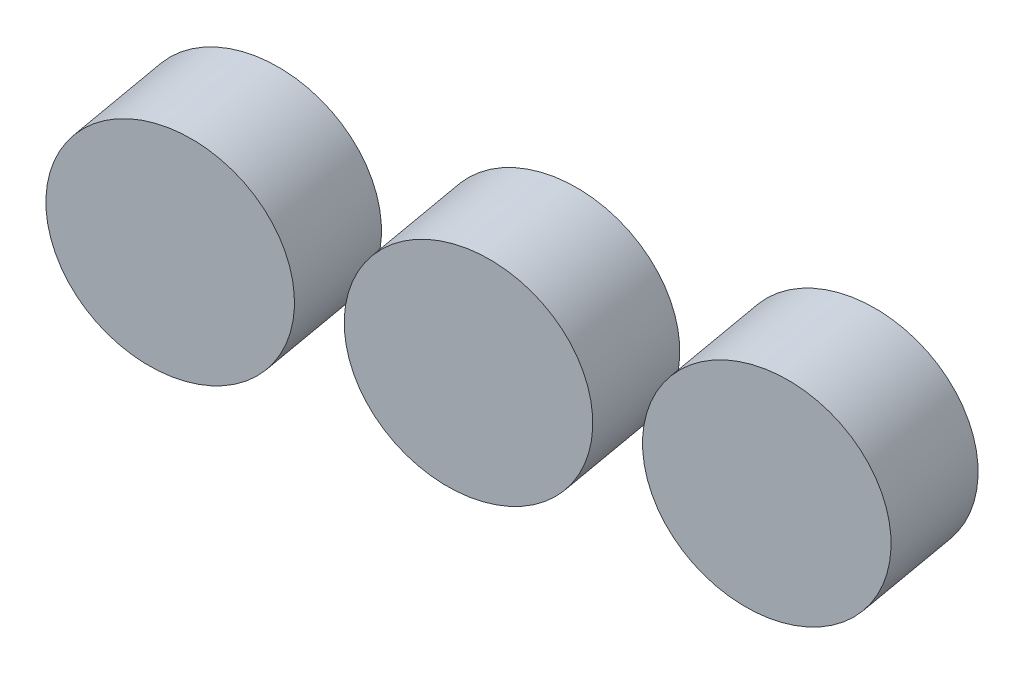
ISO-10303-21;
HEADER;
FILE_DESCRIPTION(('STEP AP214'),'2;1');
FILE_NAME('part.step','',(''),(''),'','','');
FILE_SCHEMA(('AUTOMOTIVE_DESIGN { 1 0 10303 214 1 1 1 1 }'));
ENDSEC;
DATA;
#1=APPLICATION_CONTEXT('core data for automotive mechanical design processes');
#2=APPLICATION_PROTOCOL_DEFINITION('international standard','automotive_design',2000,#1);
#3=PRODUCT_CONTEXT('',#1,'mechanical');
#4=PRODUCT('Part','Part','',(#3));
#5=PRODUCT_RELATED_PRODUCT_CATEGORY('part','',(#4));
#6=PRODUCT_DEFINITION_FORMATION('','',#4);
#7=PRODUCT_DEFINITION_CONTEXT('part definition',#1,'design');
#8=PRODUCT_DEFINITION('design','',#6,#7);
#9=PRODUCT_DEFINITION_SHAPE('','',#8);
#10=(LENGTH_UNIT() NAMED_UNIT(*) SI_UNIT(.MILLI.,.METRE.));
#11=(NAMED_UNIT(*) PLANE_ANGLE_UNIT() SI_UNIT($,.RADIAN.));
#12=(NAMED_UNIT(*) SI_UNIT($,.STERADIAN.) SOLID_ANGLE_UNIT());
#13=UNCERTAINTY_MEASURE_WITH_UNIT(LENGTH_MEASURE(1.E-05),#10,'distance_accuracy_value','');
#14=(GEOMETRIC_REPRESENTATION_CONTEXT(3) GLOBAL_UNCERTAINTY_ASSIGNED_CONTEXT((#13)) GLOBAL_UNIT_ASSIGNED_CONTEXT((#10,
#11,#12)) REPRESENTATION_CONTEXT('',''));
#15=CARTESIAN_POINT('',(0.,0.,0.));
#16=DIRECTION('',(0.,0.,1.));
#17=DIRECTION('',(1.,0.,0.));
#18=AXIS2_PLACEMENT_3D('',#15,#16,#17);
#19=CARTESIAN_POINT('',(-1156.35386072293,336.999999999994,1700.32688113994));
#20=DIRECTION('',(0.17364817766693,0.,0.984807753012208));
#21=DIRECTION('',(0.171010071662834,-0.984807753012208,-0.030153689607045));
#22=AXIS2_PLACEMENT_3D('',#19,#20,#21);
#23=CYLINDRICAL_SURFACE('',#22,25.);
#24=CARTESIAN_POINT('',(-1156.35386072293,336.999999999994,1700.32688113994));
#25=DIRECTION('',(-0.17364817766693,0.,-0.984807753012208));
#26=DIRECTION('',(0.969846310392954,0.17364817766693,-0.171010071662834));
#27=AXIS2_PLACEMENT_3D('',#24,#25,#26);
#28=CIRCLE('',#27,25.);
#29=CARTESIAN_POINT('',(-1132.10770296311,341.341204441668,1696.05162934837));
#30=VERTEX_POINT('',#29);
#31=EDGE_CURVE('E10',#30,#30,#28,.T.);
#32=ORIENTED_EDGE('',*,*,#31,.F.);
#33=EDGE_LOOP('',(#32));
#34=FACE_BOUND('',#33,.T.);
#35=CARTESIAN_POINT('',(-1152.01265628126,336.999999999994,1724.94707496524));
#36=DIRECTION('',(-0.17364817766693,0.,-0.984807753012208));
#37=DIRECTION('',(0.969846310392954,0.17364817766693,-0.171010071662834));
#38=AXIS2_PLACEMENT_3D('',#35,#36,#37);
#39=CIRCLE('',#38,25.);
#40=CARTESIAN_POINT('',(-1127.76649852143,341.341204441668,1720.67182317367));
#41=VERTEX_POINT('',#40);
#42=EDGE_CURVE('E23',#41,#41,#39,.T.);
#43=ORIENTED_EDGE('',*,*,#42,.T.);
#44=EDGE_LOOP('',(#43));
#45=FACE_BOUND('',#44,.T.);
#46=ADVANCED_FACE('F15',(#34,#45),#23,.T.);
#47=CARTESIAN_POINT('',(-1156.35386072293,336.999999999994,1700.32688113994));
#48=DIRECTION('',(-0.17364817766693,0.,-0.984807753012208));
#49=DIRECTION('',(-0.171010071662834,0.984807753012208,0.030153689607045));
#50=AXIS2_PLACEMENT_3D('',#47,#48,#49);
#51=PLANE('',#50);
#52=ORIENTED_EDGE('',*,*,#31,.T.);
#53=EDGE_LOOP('',(#52));
#54=FACE_BOUND('',#53,.T.);
#55=ADVANCED_FACE('F129',(#54),#51,.T.);
#56=CARTESIAN_POINT('',(-1152.01265628126,336.999999999994,1724.94707496524));
#57=DIRECTION('',(-0.17364817766693,0.,-0.984807753012208));
#58=DIRECTION('',(-0.171010071662834,0.984807753012208,0.030153689607045));
#59=AXIS2_PLACEMENT_3D('',#56,#57,#58);
#60=PLANE('',#59);
#61=ORIENTED_EDGE('',*,*,#42,.F.);
#62=EDGE_LOOP('',(#61));
#63=FACE_BOUND('',#62,.T.);
#64=ADVANCED_FACE('F125',(#63),#60,.F.);
#65=CLOSED_SHELL('',(#46,#55,#64));
#66=MANIFOLD_SOLID_BREP('B1',#65);
#67=CARTESIAN_POINT('',(-1097.2653955422,336.999999999995,1689.90799047993));
#68=DIRECTION('',(0.17364817766693,0.,0.984807753012208));
#69=DIRECTION('',(0.171010071662834,-0.984807753012208,-0.030153689607045));
#70=AXIS2_PLACEMENT_3D('',#67,#68,#69);
#71=CYLINDRICAL_SURFACE('',#70,25.);
#72=CARTESIAN_POINT('',(-1097.2653955422,336.999999999995,1689.90799047993));
#73=DIRECTION('',(-0.17364817766693,0.,-0.984807753012208));
#74=DIRECTION('',(0.969846310392954,0.17364817766693,-0.171010071662834));
#75=AXIS2_PLACEMENT_3D('',#72,#73,#74);
#76=CIRCLE('',#75,25.);
#77=CARTESIAN_POINT('',(-1073.01923778238,341.341204441668,1685.63273868835));
#78=VERTEX_POINT('',#77);
#79=EDGE_CURVE('E29',#78,#78,#76,.T.);
#80=ORIENTED_EDGE('',*,*,#79,.F.);
#81=EDGE_LOOP('',(#80));
#82=FACE_BOUND('',#81,.T.);
#83=CARTESIAN_POINT('',(-1092.92419110053,336.999999999995,1714.52818430523));
#84=DIRECTION('',(-0.17364817766693,0.,-0.984807753012208));
#85=DIRECTION('',(0.969846310392954,0.17364817766693,-0.171010071662834));
#86=AXIS2_PLACEMENT_3D('',#83,#84,#85);
#87=CIRCLE('',#86,25.);
#88=CARTESIAN_POINT('',(-1068.6780333407,341.341204441668,1710.25293251366));
#89=VERTEX_POINT('',#88);
#90=EDGE_CURVE('E32',#89,#89,#87,.T.);
#91=ORIENTED_EDGE('',*,*,#90,.T.);
#92=EDGE_LOOP('',(#91));
#93=FACE_BOUND('',#92,.T.);
#94=ADVANCED_FACE('F61',(#82,#93),#71,.T.);
#95=CARTESIAN_POINT('',(-1097.2653955422,336.999999999995,1689.90799047993));
#96=DIRECTION('',(-0.17364817766693,0.,-0.984807753012208));
#97=DIRECTION('',(-0.171010071662834,0.984807753012208,0.030153689607045));
#98=AXIS2_PLACEMENT_3D('',#95,#96,#97);
#99=PLANE('',#98);
#100=ORIENTED_EDGE('',*,*,#79,.T.);
#101=EDGE_LOOP('',(#100));
#102=FACE_BOUND('',#101,.T.);
#103=ADVANCED_FACE('F63',(#102),#99,.T.);
#104=CARTESIAN_POINT('',(-1092.92419110053,336.999999999995,1714.52818430523));
#105=DIRECTION('',(-0.17364817766693,0.,-0.984807753012208));
#106=DIRECTION('',(-0.171010071662834,0.984807753012208,0.030153689607045));
#107=AXIS2_PLACEMENT_3D('',#104,#105,#106);
#108=PLANE('',#107);
#109=ORIENTED_EDGE('',*,*,#90,.F.);
#110=EDGE_LOOP('',(#109));
#111=FACE_BOUND('',#110,.T.);
#112=ADVANCED_FACE('F71',(#111),#108,.F.);
#113=CLOSED_SHELL('',(#94,#103,#112));
#114=MANIFOLD_SOLID_BREP('B1',#113);
#115=CARTESIAN_POINT('',(-1038.17693036147,336.999999999995,1679.48909981991));
#116=DIRECTION('',(0.17364817766693,0.,0.984807753012208));
#117=DIRECTION('',(0.171010071662834,-0.984807753012208,-0.030153689607045));
#118=AXIS2_PLACEMENT_3D('',#115,#116,#117);
#119=CYLINDRICAL_SURFACE('',#118,25.);
#120=CARTESIAN_POINT('',(-1038.17693036147,336.999999999995,1679.48909981991));
#121=DIRECTION('',(-0.17364817766693,0.,-0.984807753012208));
#122=DIRECTION('',(0.969846310392954,0.17364817766693,-0.171010071662834));
#123=AXIS2_PLACEMENT_3D('',#120,#121,#122);
#124=CIRCLE('',#123,25.);
#125=CARTESIAN_POINT('',(-1013.93077260164,341.341204441668,1675.21384802834));
#126=VERTEX_POINT('',#125);
#127=EDGE_CURVE('E19',#126,#126,#124,.T.);
#128=ORIENTED_EDGE('',*,*,#127,.F.);
#129=EDGE_LOOP('',(#128));
#130=FACE_BOUND('',#129,.T.);
#131=CARTESIAN_POINT('',(-1033.83572591979,336.999999999995,1704.10929364521));
#132=DIRECTION('',(-0.17364817766693,0.,-0.984807753012208));
#133=DIRECTION('',(0.969846310392954,0.17364817766693,-0.171010071662834));
#134=AXIS2_PLACEMENT_3D('',#131,#132,#133);
#135=CIRCLE('',#134,25.);
#136=CARTESIAN_POINT('',(-1009.58956815997,341.341204441668,1699.83404185364));
#137=VERTEX_POINT('',#136);
#138=EDGE_CURVE('E37',#137,#137,#135,.T.);
#139=ORIENTED_EDGE('',*,*,#138,.T.);
#140=EDGE_LOOP('',(#139));
#141=FACE_BOUND('',#140,.T.);
#142=ADVANCED_FACE('F17',(#130,#141),#119,.T.);
#143=CARTESIAN_POINT('',(-1038.17693036147,336.999999999995,1679.48909981991));
#144=DIRECTION('',(-0.17364817766693,0.,-0.984807753012208));
#145=DIRECTION('',(-0.171010071662834,0.984807753012208,0.030153689607045));
#146=AXIS2_PLACEMENT_3D('',#143,#144,#145);
#147=PLANE('',#146);
#148=ORIENTED_EDGE('',*,*,#127,.T.);
#149=EDGE_LOOP('',(#148));
#150=FACE_BOUND('',#149,.T.);
#151=ADVANCED_FACE('F47',(#150),#147,.T.);
#152=CARTESIAN_POINT('',(-1033.83572591979,336.999999999995,1704.10929364521));
#153=DIRECTION('',(-0.17364817766693,0.,-0.984807753012208));
#154=DIRECTION('',(-0.171010071662834,0.984807753012208,0.030153689607045));
#155=AXIS2_PLACEMENT_3D('',#152,#153,#154);
#156=PLANE('',#155);
#157=ORIENTED_EDGE('',*,*,#138,.F.);
#158=EDGE_LOOP('',(#157));
#159=FACE_BOUND('',#158,.T.);
#160=ADVANCED_FACE('F57',(#159),#156,.F.);
#161=CLOSED_SHELL('',(#142,#151,#160));
#162=MANIFOLD_SOLID_BREP('B1',#161);
#163=ADVANCED_BREP_SHAPE_REPRESENTATION('',(#18,#66,#114,#162),#14);
#164=SHAPE_DEFINITION_REPRESENTATION(#9,#163);
ENDSEC;
END-ISO-10303-21;
